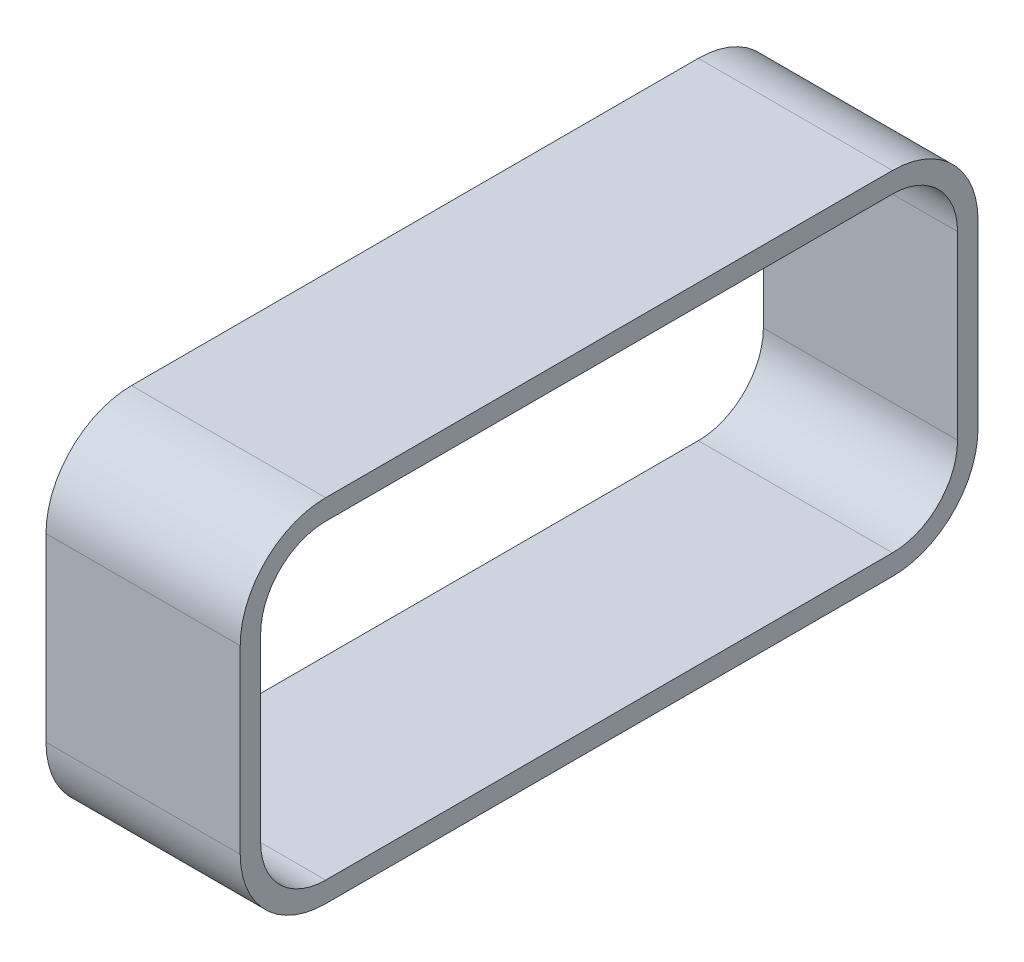
ISO-10303-21;
HEADER;
FILE_DESCRIPTION(('STEP AP214'),'2;1');
FILE_NAME('part.step','',(''),(''),'','','');
FILE_SCHEMA(('AUTOMOTIVE_DESIGN { 1 0 10303 214 1 1 1 1 }'));
ENDSEC;
DATA;
#1=APPLICATION_CONTEXT('core data for automotive mechanical design processes');
#2=APPLICATION_PROTOCOL_DEFINITION('international standard','automotive_design',2000,#1);
#3=PRODUCT_CONTEXT('',#1,'mechanical');
#4=PRODUCT('Part','Part','',(#3));
#5=PRODUCT_RELATED_PRODUCT_CATEGORY('part','',(#4));
#6=PRODUCT_DEFINITION_FORMATION('','',#4);
#7=PRODUCT_DEFINITION_CONTEXT('part definition',#1,'design');
#8=PRODUCT_DEFINITION('design','',#6,#7);
#9=PRODUCT_DEFINITION_SHAPE('','',#8);
#10=(LENGTH_UNIT() NAMED_UNIT(*) SI_UNIT(.MILLI.,.METRE.));
#11=(NAMED_UNIT(*) PLANE_ANGLE_UNIT() SI_UNIT($,.RADIAN.));
#12=(NAMED_UNIT(*) SI_UNIT($,.STERADIAN.) SOLID_ANGLE_UNIT());
#13=UNCERTAINTY_MEASURE_WITH_UNIT(LENGTH_MEASURE(1.E-05),#10,'distance_accuracy_value','');
#14=(GEOMETRIC_REPRESENTATION_CONTEXT(3) GLOBAL_UNCERTAINTY_ASSIGNED_CONTEXT((#13)) GLOBAL_UNIT_ASSIGNED_CONTEXT((#10,
#11,#12)) REPRESENTATION_CONTEXT('',''));
#15=CARTESIAN_POINT('',(0.,0.,0.));
#16=DIRECTION('',(0.,0.,1.));
#17=DIRECTION('',(1.,0.,0.));
#18=AXIS2_PLACEMENT_3D('',#15,#16,#17);
#19=CARTESIAN_POINT('',(1045.,1322.,-3050.));
#20=DIRECTION('',(-1.,0.,0.));
#21=DIRECTION('',(0.,0.,1.));
#22=AXIS2_PLACEMENT_3D('',#19,#20,#21);
#23=PLANE('',#22);
#24=CARTESIAN_POINT('',(1045.,1322.,-3050.));
#25=DIRECTION('',(1.,0.,0.));
#26=DIRECTION('',(0.,0.,1.));
#27=AXIS2_PLACEMENT_3D('',#24,#25,#26);
#28=CIRCLE('',#27,459.999999999999);
#29=CARTESIAN_POINT('',(1045.,1322.,-3510.));
#30=VERTEX_POINT('',#29);
#31=CARTESIAN_POINT('',(1045.,1782.,-3050.));
#32=VERTEX_POINT('',#31);
#33=EDGE_CURVE('E241',#30,#32,#28,.T.);
#34=ORIENTED_EDGE('',*,*,#33,.T.);
#35=DIRECTION('',(0.,0.,1.));
#36=VECTOR('',#35,1.);
#37=CARTESIAN_POINT('',(1045.,1782.,-4.44089209850063E-13));
#38=LINE('',#37,#36);
#39=CARTESIAN_POINT('',(1045.,1782.,-4.44089209850063E-13));
#40=VERTEX_POINT('',#39);
#41=EDGE_CURVE('E245',#32,#40,#38,.T.);
#42=ORIENTED_EDGE('',*,*,#41,.T.);
#43=CARTESIAN_POINT('',(1045.,1322.,-4.44089209850063E-13));
#44=DIRECTION('',(1.,0.,0.));
#45=DIRECTION('',(0.,0.,-1.));
#46=AXIS2_PLACEMENT_3D('',#43,#44,#45);
#47=CIRCLE('',#46,459.999999999999);
#48=CARTESIAN_POINT('',(1045.,1322.,459.999999999999));
#49=VERTEX_POINT('',#48);
#50=EDGE_CURVE('E249',#40,#49,#47,.T.);
#51=ORIENTED_EDGE('',*,*,#50,.T.);
#52=DIRECTION('',(0.,-1.,0.));
#53=VECTOR('',#52,1.);
#54=CARTESIAN_POINT('',(1045.,1322.,459.999999999998));
#55=LINE('',#54,#53);
#56=CARTESIAN_POINT('',(1045.,350.,459.999999999998));
#57=VERTEX_POINT('',#56);
#58=EDGE_CURVE('E252',#49,#57,#55,.T.);
#59=ORIENTED_EDGE('',*,*,#58,.T.);
#60=CARTESIAN_POINT('',(1045.,350.,3.60822483003176E-12));
#61=DIRECTION('',(1.,0.,0.));
#62=DIRECTION('',(0.,0.,-1.));
#63=AXIS2_PLACEMENT_3D('',#60,#61,#62);
#64=CIRCLE('',#63,459.999999999995);
#65=CARTESIAN_POINT('',(1045.,-109.999999999995,0.));
#66=VERTEX_POINT('',#65);
#67=EDGE_CURVE('E255',#57,#66,#64,.T.);
#68=ORIENTED_EDGE('',*,*,#67,.T.);
#69=DIRECTION('',(0.,0.,-1.));
#70=VECTOR('',#69,1.);
#71=CARTESIAN_POINT('',(1045.,-109.999999999995,-3050.));
#72=LINE('',#71,#70);
#73=CARTESIAN_POINT('',(1045.,-109.999999999995,-3050.));
#74=VERTEX_POINT('',#73);
#75=EDGE_CURVE('E258',#66,#74,#72,.T.);
#76=ORIENTED_EDGE('',*,*,#75,.T.);
#77=CARTESIAN_POINT('',(1045.,350.,-3050.));
#78=DIRECTION('',(1.,0.,0.));
#79=DIRECTION('',(0.,0.,1.));
#80=AXIS2_PLACEMENT_3D('',#77,#78,#79);
#81=CIRCLE('',#80,459.999999999995);
#82=CARTESIAN_POINT('',(1045.,350.,-3510.));
#83=VERTEX_POINT('',#82);
#84=EDGE_CURVE('E261',#74,#83,#81,.T.);
#85=ORIENTED_EDGE('',*,*,#84,.T.);
#86=DIRECTION('',(0.,1.,0.));
#87=VECTOR('',#86,1.);
#88=CARTESIAN_POINT('',(1045.,1322.,-3510.));
#89=LINE('',#88,#87);
#90=EDGE_CURVE('E264',#83,#30,#89,.T.);
#91=ORIENTED_EDGE('',*,*,#90,.T.);
#92=EDGE_LOOP('',(#34,#42,#51,#59,#68,#76,#85,#91));
#93=FACE_BOUND('',#92,.T.);
#94=CARTESIAN_POINT('',(1045.,350.,0.));
#95=DIRECTION('',(1.,0.,0.));
#96=DIRECTION('',(0.,0.,1.));
#97=AXIS2_PLACEMENT_3D('',#94,#95,#96);
#98=CIRCLE('',#97,350.);
#99=CARTESIAN_POINT('',(1045.,350.,350.));
#100=VERTEX_POINT('',#99);
#101=CARTESIAN_POINT('',(1045.,0.,0.));
#102=VERTEX_POINT('',#101);
#103=EDGE_CURVE('E152',#100,#102,#98,.T.);
#104=ORIENTED_EDGE('',*,*,#103,.F.);
#105=DIRECTION('',(0.,-1.,0.));
#106=VECTOR('',#105,1.);
#107=CARTESIAN_POINT('',(1045.,350.,350.));
#108=LINE('',#107,#106);
#109=CARTESIAN_POINT('',(1045.,1322.,350.));
#110=VERTEX_POINT('',#109);
#111=EDGE_CURVE('E193',#110,#100,#108,.T.);
#112=ORIENTED_EDGE('',*,*,#111,.F.);
#113=CARTESIAN_POINT('',(1045.,1322.,9.43689570931383E-13));
#114=DIRECTION('',(1.,0.,0.));
#115=DIRECTION('',(0.,0.,1.));
#116=AXIS2_PLACEMENT_3D('',#113,#114,#115);
#117=CIRCLE('',#116,349.999999999999);
#118=CARTESIAN_POINT('',(1045.,1672.,-4.44089209850063E-13));
#119=VERTEX_POINT('',#118);
#120=EDGE_CURVE('E190',#119,#110,#117,.T.);
#121=ORIENTED_EDGE('',*,*,#120,.F.);
#122=DIRECTION('',(0.,0.,1.));
#123=VECTOR('',#122,1.);
#124=CARTESIAN_POINT('',(1045.,1672.,-3050.));
#125=LINE('',#124,#123);
#126=CARTESIAN_POINT('',(1045.,1672.,-3050.));
#127=VERTEX_POINT('',#126);
#128=EDGE_CURVE('E187',#127,#119,#125,.T.);
#129=ORIENTED_EDGE('',*,*,#128,.F.);
#130=CARTESIAN_POINT('',(1045.,1322.,-3050.));
#131=DIRECTION('',(1.,0.,0.));
#132=DIRECTION('',(0.,0.,1.));
#133=AXIS2_PLACEMENT_3D('',#130,#131,#132);
#134=CIRCLE('',#133,350.);
#135=CARTESIAN_POINT('',(1045.,1322.,-3400.));
#136=VERTEX_POINT('',#135);
#137=EDGE_CURVE('E184',#136,#127,#134,.T.);
#138=ORIENTED_EDGE('',*,*,#137,.F.);
#139=DIRECTION('',(0.,1.,0.));
#140=VECTOR('',#139,1.);
#141=CARTESIAN_POINT('',(1045.,1322.,-3400.));
#142=LINE('',#141,#140);
#143=CARTESIAN_POINT('',(1045.,350.,-3400.));
#144=VERTEX_POINT('',#143);
#145=EDGE_CURVE('E179',#144,#136,#142,.T.);
#146=ORIENTED_EDGE('',*,*,#145,.F.);
#147=CARTESIAN_POINT('',(1045.,350.,-3050.));
#148=DIRECTION('',(1.,0.,0.));
#149=DIRECTION('',(0.,0.,-1.));
#150=AXIS2_PLACEMENT_3D('',#147,#148,#149);
#151=CIRCLE('',#150,350.);
#152=CARTESIAN_POINT('',(1045.,0.,-3050.));
#153=VERTEX_POINT('',#152);
#154=EDGE_CURVE('E175',#153,#144,#151,.T.);
#155=ORIENTED_EDGE('',*,*,#154,.F.);
#156=DIRECTION('',(0.,0.,-1.));
#157=VECTOR('',#156,1.);
#158=CARTESIAN_POINT('',(1045.,0.,0.));
#159=LINE('',#158,#157);
#160=EDGE_CURVE('E161',#102,#153,#159,.T.);
#161=ORIENTED_EDGE('',*,*,#160,.F.);
#162=EDGE_LOOP('',(#104,#112,#121,#129,#138,#146,#155,#161));
#163=FACE_BOUND('',#162,.T.);
#164=ADVANCED_FACE('F38',(#93,#163),#23,.F.);
#165=CARTESIAN_POINT('',(0.,1322.,-3050.));
#166=DIRECTION('',(-1.,0.,0.));
#167=DIRECTION('',(0.,0.,1.));
#168=AXIS2_PLACEMENT_3D('',#165,#166,#167);
#169=PLANE('',#168);
#170=CARTESIAN_POINT('',(0.,1322.,-3050.));
#171=DIRECTION('',(1.,0.,0.));
#172=DIRECTION('',(0.,0.,1.));
#173=AXIS2_PLACEMENT_3D('',#170,#171,#172);
#174=CIRCLE('',#173,459.999999999999);
#175=CARTESIAN_POINT('',(0.,1322.,-3510.));
#176=VERTEX_POINT('',#175);
#177=CARTESIAN_POINT('',(0.,1782.,-3050.));
#178=VERTEX_POINT('',#177);
#179=EDGE_CURVE('E170',#176,#178,#174,.T.);
#180=ORIENTED_EDGE('',*,*,#179,.F.);
#181=DIRECTION('',(0.,1.,0.));
#182=VECTOR('',#181,1.);
#183=CARTESIAN_POINT('',(0.,1322.,-3510.));
#184=LINE('',#183,#182);
#185=CARTESIAN_POINT('',(0.,350.,-3510.));
#186=VERTEX_POINT('',#185);
#187=EDGE_CURVE('E246',#186,#176,#184,.T.);
#188=ORIENTED_EDGE('',*,*,#187,.F.);
#189=CARTESIAN_POINT('',(0.,350.,-3050.));
#190=DIRECTION('',(1.,0.,0.));
#191=DIRECTION('',(0.,0.,1.));
#192=AXIS2_PLACEMENT_3D('',#189,#190,#191);
#193=CIRCLE('',#192,459.999999999995);
#194=CARTESIAN_POINT('',(0.,-109.999999999995,-3050.));
#195=VERTEX_POINT('',#194);
#196=EDGE_CURVE('E286',#195,#186,#193,.T.);
#197=ORIENTED_EDGE('',*,*,#196,.F.);
#198=DIRECTION('',(0.,0.,-1.));
#199=VECTOR('',#198,1.);
#200=CARTESIAN_POINT('',(0.,-109.999999999995,-3050.));
#201=LINE('',#200,#199);
#202=CARTESIAN_POINT('',(0.,-109.999999999995,0.));
#203=VERTEX_POINT('',#202);
#204=EDGE_CURVE('E283',#203,#195,#201,.T.);
#205=ORIENTED_EDGE('',*,*,#204,.F.);
#206=CARTESIAN_POINT('',(0.,350.,3.60822483003176E-12));
#207=DIRECTION('',(1.,0.,0.));
#208=DIRECTION('',(0.,0.,-1.));
#209=AXIS2_PLACEMENT_3D('',#206,#207,#208);
#210=CIRCLE('',#209,459.999999999995);
#211=CARTESIAN_POINT('',(0.,350.,459.999999999998));
#212=VERTEX_POINT('',#211);
#213=EDGE_CURVE('E280',#212,#203,#210,.T.);
#214=ORIENTED_EDGE('',*,*,#213,.F.);
#215=DIRECTION('',(0.,-1.,0.));
#216=VECTOR('',#215,1.);
#217=CARTESIAN_POINT('',(0.,1322.,459.999999999998));
#218=LINE('',#217,#216);
#219=CARTESIAN_POINT('',(0.,1322.,459.999999999999));
#220=VERTEX_POINT('',#219);
#221=EDGE_CURVE('E277',#220,#212,#218,.T.);
#222=ORIENTED_EDGE('',*,*,#221,.F.);
#223=CARTESIAN_POINT('',(0.,1322.,-4.44089209850063E-13));
#224=DIRECTION('',(1.,0.,0.));
#225=DIRECTION('',(0.,0.,-1.));
#226=AXIS2_PLACEMENT_3D('',#223,#224,#225);
#227=CIRCLE('',#226,459.999999999999);
#228=CARTESIAN_POINT('',(0.,1782.,-4.44089209850063E-13));
#229=VERTEX_POINT('',#228);
#230=EDGE_CURVE('E274',#229,#220,#227,.T.);
#231=ORIENTED_EDGE('',*,*,#230,.F.);
#232=DIRECTION('',(0.,0.,1.));
#233=VECTOR('',#232,1.);
#234=CARTESIAN_POINT('',(0.,1782.,-4.44089209850063E-13));
#235=LINE('',#234,#233);
#236=EDGE_CURVE('E271',#178,#229,#235,.T.);
#237=ORIENTED_EDGE('',*,*,#236,.F.);
#238=EDGE_LOOP('',(#180,#188,#197,#205,#214,#222,#231,#237));
#239=FACE_BOUND('',#238,.T.);
#240=DIRECTION('',(0.,-1.,0.));
#241=VECTOR('',#240,1.);
#242=CARTESIAN_POINT('',(0.,350.,350.));
#243=LINE('',#242,#241);
#244=CARTESIAN_POINT('',(0.,1322.,350.));
#245=VERTEX_POINT('',#244);
#246=CARTESIAN_POINT('',(0.,350.,350.));
#247=VERTEX_POINT('',#246);
#248=EDGE_CURVE('E162',#245,#247,#243,.T.);
#249=ORIENTED_EDGE('',*,*,#248,.T.);
#250=CARTESIAN_POINT('',(0.,350.,0.));
#251=DIRECTION('',(1.,0.,0.));
#252=DIRECTION('',(0.,0.,1.));
#253=AXIS2_PLACEMENT_3D('',#250,#251,#252);
#254=CIRCLE('',#253,350.);
#255=CARTESIAN_POINT('',(0.,0.,0.));
#256=VERTEX_POINT('',#255);
#257=EDGE_CURVE('E62',#247,#256,#254,.T.);
#258=ORIENTED_EDGE('',*,*,#257,.T.);
#259=DIRECTION('',(0.,0.,-1.));
#260=VECTOR('',#259,1.);
#261=CARTESIAN_POINT('',(0.,0.,0.));
#262=LINE('',#261,#260);
#263=CARTESIAN_POINT('',(0.,0.,-3050.));
#264=VERTEX_POINT('',#263);
#265=EDGE_CURVE('E168',#256,#264,#262,.T.);
#266=ORIENTED_EDGE('',*,*,#265,.T.);
#267=CARTESIAN_POINT('',(0.,350.,-3050.));
#268=DIRECTION('',(1.,0.,0.));
#269=DIRECTION('',(0.,0.,-1.));
#270=AXIS2_PLACEMENT_3D('',#267,#268,#269);
#271=CIRCLE('',#270,350.);
#272=CARTESIAN_POINT('',(0.,350.,-3400.));
#273=VERTEX_POINT('',#272);
#274=EDGE_CURVE('E200',#264,#273,#271,.T.);
#275=ORIENTED_EDGE('',*,*,#274,.T.);
#276=DIRECTION('',(0.,1.,0.));
#277=VECTOR('',#276,1.);
#278=CARTESIAN_POINT('',(0.,1322.,-3400.));
#279=LINE('',#278,#277);
#280=CARTESIAN_POINT('',(0.,1322.,-3400.));
#281=VERTEX_POINT('',#280);
#282=EDGE_CURVE('E204',#273,#281,#279,.T.);
#283=ORIENTED_EDGE('',*,*,#282,.T.);
#284=CARTESIAN_POINT('',(0.,1322.,-3050.));
#285=DIRECTION('',(1.,0.,0.));
#286=DIRECTION('',(0.,0.,1.));
#287=AXIS2_PLACEMENT_3D('',#284,#285,#286);
#288=CIRCLE('',#287,350.);
#289=CARTESIAN_POINT('',(0.,1672.,-3050.));
#290=VERTEX_POINT('',#289);
#291=EDGE_CURVE('E208',#281,#290,#288,.T.);
#292=ORIENTED_EDGE('',*,*,#291,.T.);
#293=DIRECTION('',(0.,0.,1.));
#294=VECTOR('',#293,1.);
#295=CARTESIAN_POINT('',(0.,1672.,-3050.));
#296=LINE('',#295,#294);
#297=CARTESIAN_POINT('',(0.,1672.,-4.44089209850063E-13));
#298=VERTEX_POINT('',#297);
#299=EDGE_CURVE('E212',#290,#298,#296,.T.);
#300=ORIENTED_EDGE('',*,*,#299,.T.);
#301=CARTESIAN_POINT('',(0.,1322.,9.43689570931383E-13));
#302=DIRECTION('',(1.,0.,0.));
#303=DIRECTION('',(0.,0.,1.));
#304=AXIS2_PLACEMENT_3D('',#301,#302,#303);
#305=CIRCLE('',#304,349.999999999999);
#306=EDGE_CURVE('E216',#298,#245,#305,.T.);
#307=ORIENTED_EDGE('',*,*,#306,.T.);
#308=EDGE_LOOP('',(#249,#258,#266,#275,#283,#292,#300,#307));
#309=FACE_BOUND('',#308,.T.);
#310=ADVANCED_FACE('F325',(#239,#309),#169,.T.);
#311=CARTESIAN_POINT('',(1045.,1322.,-3050.));
#312=DIRECTION('',(-1.,0.,0.));
#313=DIRECTION('',(0.,0.,1.));
#314=AXIS2_PLACEMENT_3D('',#311,#312,#313);
#315=CYLINDRICAL_SURFACE('',#314,459.999999999999);
#316=ORIENTED_EDGE('',*,*,#179,.T.);
#317=DIRECTION('',(-1.,0.,0.));
#318=VECTOR('',#317,1.);
#319=CARTESIAN_POINT('',(1045.,1782.,-3050.));
#320=LINE('',#319,#318);
#321=EDGE_CURVE('E11',#32,#178,#320,.T.);
#322=ORIENTED_EDGE('',*,*,#321,.F.);
#323=ORIENTED_EDGE('',*,*,#33,.F.);
#324=DIRECTION('',(-1.,0.,0.));
#325=VECTOR('',#324,1.);
#326=CARTESIAN_POINT('',(1045.,1322.,-3510.));
#327=LINE('',#326,#325);
#328=EDGE_CURVE('E267',#30,#176,#327,.T.);
#329=ORIENTED_EDGE('',*,*,#328,.T.);
#330=EDGE_LOOP('',(#316,#322,#323,#329));
#331=FACE_BOUND('',#330,.T.);
#332=ADVANCED_FACE('F40',(#331),#315,.T.);
#333=CARTESIAN_POINT('',(1045.,1782.,-4.44089209850063E-13));
#334=DIRECTION('',(0.,-1.,0.));
#335=DIRECTION('',(0.,0.,-1.));
#336=AXIS2_PLACEMENT_3D('',#333,#334,#335);
#337=PLANE('',#336);
#338=ORIENTED_EDGE('',*,*,#236,.T.);
#339=DIRECTION('',(-1.,0.,0.));
#340=VECTOR('',#339,1.);
#341=CARTESIAN_POINT('',(1045.,1782.,-4.44089209850063E-13));
#342=LINE('',#341,#340);
#343=EDGE_CURVE('E47',#40,#229,#342,.T.);
#344=ORIENTED_EDGE('',*,*,#343,.F.);
#345=ORIENTED_EDGE('',*,*,#41,.F.);
#346=ORIENTED_EDGE('',*,*,#321,.T.);
#347=EDGE_LOOP('',(#338,#344,#345,#346));
#348=FACE_BOUND('',#347,.T.);
#349=ADVANCED_FACE('F342',(#348),#337,.F.);
#350=CARTESIAN_POINT('',(1045.,1322.,-4.44089209850063E-13));
#351=DIRECTION('',(-1.,0.,0.));
#352=DIRECTION('',(0.,0.,1.));
#353=AXIS2_PLACEMENT_3D('',#350,#351,#352);
#354=CYLINDRICAL_SURFACE('',#353,459.999999999999);
#355=ORIENTED_EDGE('',*,*,#230,.T.);
#356=DIRECTION('',(-1.,0.,0.));
#357=VECTOR('',#356,1.);
#358=CARTESIAN_POINT('',(1045.,1322.,459.999999999999));
#359=LINE('',#358,#357);
#360=EDGE_CURVE('E310',#49,#220,#359,.T.);
#361=ORIENTED_EDGE('',*,*,#360,.F.);
#362=ORIENTED_EDGE('',*,*,#50,.F.);
#363=ORIENTED_EDGE('',*,*,#343,.T.);
#364=EDGE_LOOP('',(#355,#361,#362,#363));
#365=FACE_BOUND('',#364,.T.);
#366=ADVANCED_FACE('F319',(#365),#354,.T.);
#367=CARTESIAN_POINT('',(1045.,1322.,459.999999999998));
#368=DIRECTION('',(0.,0.,-1.));
#369=DIRECTION('',(-1.,0.,0.));
#370=AXIS2_PLACEMENT_3D('',#367,#368,#369);
#371=PLANE('',#370);
#372=ORIENTED_EDGE('',*,*,#221,.T.);
#373=DIRECTION('',(-1.,0.,0.));
#374=VECTOR('',#373,1.);
#375=CARTESIAN_POINT('',(1045.,350.,459.999999999998));
#376=LINE('',#375,#374);
#377=EDGE_CURVE('E306',#57,#212,#376,.T.);
#378=ORIENTED_EDGE('',*,*,#377,.F.);
#379=ORIENTED_EDGE('',*,*,#58,.F.);
#380=ORIENTED_EDGE('',*,*,#360,.T.);
#381=EDGE_LOOP('',(#372,#378,#379,#380));
#382=FACE_BOUND('',#381,.T.);
#383=ADVANCED_FACE('F331',(#382),#371,.F.);
#384=CARTESIAN_POINT('',(1045.,350.,3.60822483003176E-12));
#385=DIRECTION('',(-1.,0.,0.));
#386=DIRECTION('',(0.,0.,1.));
#387=AXIS2_PLACEMENT_3D('',#384,#385,#386);
#388=CYLINDRICAL_SURFACE('',#387,459.999999999995);
#389=ORIENTED_EDGE('',*,*,#213,.T.);
#390=DIRECTION('',(-1.,0.,0.));
#391=VECTOR('',#390,1.);
#392=CARTESIAN_POINT('',(1045.,-109.999999999995,0.));
#393=LINE('',#392,#391);
#394=EDGE_CURVE('E302',#66,#203,#393,.T.);
#395=ORIENTED_EDGE('',*,*,#394,.F.);
#396=ORIENTED_EDGE('',*,*,#67,.F.);
#397=ORIENTED_EDGE('',*,*,#377,.T.);
#398=EDGE_LOOP('',(#389,#395,#396,#397));
#399=FACE_BOUND('',#398,.T.);
#400=ADVANCED_FACE('F335',(#399),#388,.T.);
#401=CARTESIAN_POINT('',(1045.,-109.999999999995,-3050.));
#402=DIRECTION('',(0.,1.,0.));
#403=DIRECTION('',(0.,0.,1.));
#404=AXIS2_PLACEMENT_3D('',#401,#402,#403);
#405=PLANE('',#404);
#406=ORIENTED_EDGE('',*,*,#204,.T.);
#407=DIRECTION('',(-1.,0.,0.));
#408=VECTOR('',#407,1.);
#409=CARTESIAN_POINT('',(1045.,-109.999999999995,-3050.));
#410=LINE('',#409,#408);
#411=EDGE_CURVE('E298',#74,#195,#410,.T.);
#412=ORIENTED_EDGE('',*,*,#411,.F.);
#413=ORIENTED_EDGE('',*,*,#75,.F.);
#414=ORIENTED_EDGE('',*,*,#394,.T.);
#415=EDGE_LOOP('',(#406,#412,#413,#414));
#416=FACE_BOUND('',#415,.T.);
#417=ADVANCED_FACE('F355',(#416),#405,.F.);
#418=CARTESIAN_POINT('',(1045.,350.,-3050.));
#419=DIRECTION('',(-1.,0.,0.));
#420=DIRECTION('',(0.,0.,1.));
#421=AXIS2_PLACEMENT_3D('',#418,#419,#420);
#422=CYLINDRICAL_SURFACE('',#421,459.999999999995);
#423=ORIENTED_EDGE('',*,*,#196,.T.);
#424=DIRECTION('',(-1.,0.,0.));
#425=VECTOR('',#424,1.);
#426=CARTESIAN_POINT('',(1045.,350.,-3510.));
#427=LINE('',#426,#425);
#428=EDGE_CURVE('E294',#83,#186,#427,.T.);
#429=ORIENTED_EDGE('',*,*,#428,.F.);
#430=ORIENTED_EDGE('',*,*,#84,.F.);
#431=ORIENTED_EDGE('',*,*,#411,.T.);
#432=EDGE_LOOP('',(#423,#429,#430,#431));
#433=FACE_BOUND('',#432,.T.);
#434=ADVANCED_FACE('F353',(#433),#422,.T.);
#435=CARTESIAN_POINT('',(1045.,1322.,-3510.));
#436=DIRECTION('',(0.,0.,1.));
#437=DIRECTION('',(1.,0.,0.));
#438=AXIS2_PLACEMENT_3D('',#435,#436,#437);
#439=PLANE('',#438);
#440=ORIENTED_EDGE('',*,*,#187,.T.);
#441=ORIENTED_EDGE('',*,*,#328,.F.);
#442=ORIENTED_EDGE('',*,*,#90,.F.);
#443=ORIENTED_EDGE('',*,*,#428,.T.);
#444=EDGE_LOOP('',(#440,#441,#442,#443));
#445=FACE_BOUND('',#444,.T.);
#446=ADVANCED_FACE('F348',(#445),#439,.F.);
#447=CARTESIAN_POINT('',(1045.,350.,0.));
#448=DIRECTION('',(-1.,0.,0.));
#449=DIRECTION('',(0.,0.,1.));
#450=AXIS2_PLACEMENT_3D('',#447,#448,#449);
#451=CYLINDRICAL_SURFACE('',#450,350.);
#452=ORIENTED_EDGE('',*,*,#257,.F.);
#453=DIRECTION('',(-1.,0.,0.));
#454=VECTOR('',#453,1.);
#455=CARTESIAN_POINT('',(1045.,350.,350.));
#456=LINE('',#455,#454);
#457=EDGE_CURVE('E156',#100,#247,#456,.T.);
#458=ORIENTED_EDGE('',*,*,#457,.F.);
#459=ORIENTED_EDGE('',*,*,#103,.T.);
#460=DIRECTION('',(-1.,0.,0.));
#461=VECTOR('',#460,1.);
#462=CARTESIAN_POINT('',(1045.,0.,0.));
#463=LINE('',#462,#461);
#464=EDGE_CURVE('E155',#102,#256,#463,.T.);
#465=ORIENTED_EDGE('',*,*,#464,.T.);
#466=EDGE_LOOP('',(#452,#458,#459,#465));
#467=FACE_BOUND('',#466,.T.);
#468=ADVANCED_FACE('F154',(#467),#451,.F.);
#469=CARTESIAN_POINT('',(1045.,0.,0.));
#470=DIRECTION('',(0.,1.,0.));
#471=DIRECTION('',(0.,0.,1.));
#472=AXIS2_PLACEMENT_3D('',#469,#470,#471);
#473=PLANE('',#472);
#474=ORIENTED_EDGE('',*,*,#265,.F.);
#475=ORIENTED_EDGE('',*,*,#464,.F.);
#476=ORIENTED_EDGE('',*,*,#160,.T.);
#477=DIRECTION('',(-1.,0.,0.));
#478=VECTOR('',#477,1.);
#479=CARTESIAN_POINT('',(1045.,0.,-3050.));
#480=LINE('',#479,#478);
#481=EDGE_CURVE('E171',#153,#264,#480,.T.);
#482=ORIENTED_EDGE('',*,*,#481,.T.);
#483=EDGE_LOOP('',(#474,#475,#476,#482));
#484=FACE_BOUND('',#483,.T.);
#485=ADVANCED_FACE('F165',(#484),#473,.T.);
#486=CARTESIAN_POINT('',(1045.,350.,-3050.));
#487=DIRECTION('',(-1.,0.,0.));
#488=DIRECTION('',(0.,0.,1.));
#489=AXIS2_PLACEMENT_3D('',#486,#487,#488);
#490=CYLINDRICAL_SURFACE('',#489,350.);
#491=ORIENTED_EDGE('',*,*,#274,.F.);
#492=ORIENTED_EDGE('',*,*,#481,.F.);
#493=ORIENTED_EDGE('',*,*,#154,.T.);
#494=DIRECTION('',(-1.,0.,0.));
#495=VECTOR('',#494,1.);
#496=CARTESIAN_POINT('',(1045.,350.,-3400.));
#497=LINE('',#496,#495);
#498=EDGE_CURVE('E236',#144,#273,#497,.T.);
#499=ORIENTED_EDGE('',*,*,#498,.T.);
#500=EDGE_LOOP('',(#491,#492,#493,#499));
#501=FACE_BOUND('',#500,.T.);
#502=ADVANCED_FACE('F380',(#501),#490,.F.);
#503=CARTESIAN_POINT('',(1045.,1322.,-3400.));
#504=DIRECTION('',(0.,0.,1.));
#505=DIRECTION('',(0.,-1.,0.));
#506=AXIS2_PLACEMENT_3D('',#503,#504,#505);
#507=PLANE('',#506);
#508=ORIENTED_EDGE('',*,*,#282,.F.);
#509=ORIENTED_EDGE('',*,*,#498,.F.);
#510=ORIENTED_EDGE('',*,*,#145,.T.);
#511=DIRECTION('',(-1.,0.,0.));
#512=VECTOR('',#511,1.);
#513=CARTESIAN_POINT('',(1045.,1322.,-3400.));
#514=LINE('',#513,#512);
#515=EDGE_CURVE('E233',#136,#281,#514,.T.);
#516=ORIENTED_EDGE('',*,*,#515,.T.);
#517=EDGE_LOOP('',(#508,#509,#510,#516));
#518=FACE_BOUND('',#517,.T.);
#519=ADVANCED_FACE('F384',(#518),#507,.T.);
#520=CARTESIAN_POINT('',(1045.,1322.,-3050.));
#521=DIRECTION('',(-1.,0.,0.));
#522=DIRECTION('',(0.,0.,1.));
#523=AXIS2_PLACEMENT_3D('',#520,#521,#522);
#524=CYLINDRICAL_SURFACE('',#523,350.);
#525=ORIENTED_EDGE('',*,*,#291,.F.);
#526=ORIENTED_EDGE('',*,*,#515,.F.);
#527=ORIENTED_EDGE('',*,*,#137,.T.);
#528=DIRECTION('',(-1.,0.,0.));
#529=VECTOR('',#528,1.);
#530=CARTESIAN_POINT('',(1045.,1672.,-3050.));
#531=LINE('',#530,#529);
#532=EDGE_CURVE('E230',#127,#290,#531,.T.);
#533=ORIENTED_EDGE('',*,*,#532,.T.);
#534=EDGE_LOOP('',(#525,#526,#527,#533));
#535=FACE_BOUND('',#534,.T.);
#536=ADVANCED_FACE('F390',(#535),#524,.F.);
#537=CARTESIAN_POINT('',(1045.,1672.,-3050.));
#538=DIRECTION('',(0.,-1.,0.));
#539=DIRECTION('',(0.,0.,-1.));
#540=AXIS2_PLACEMENT_3D('',#537,#538,#539);
#541=PLANE('',#540);
#542=ORIENTED_EDGE('',*,*,#299,.F.);
#543=ORIENTED_EDGE('',*,*,#532,.F.);
#544=ORIENTED_EDGE('',*,*,#128,.T.);
#545=DIRECTION('',(-1.,0.,0.));
#546=VECTOR('',#545,1.);
#547=CARTESIAN_POINT('',(1045.,1672.,-4.44089209850063E-13));
#548=LINE('',#547,#546);
#549=EDGE_CURVE('E227',#119,#298,#548,.T.);
#550=ORIENTED_EDGE('',*,*,#549,.T.);
#551=EDGE_LOOP('',(#542,#543,#544,#550));
#552=FACE_BOUND('',#551,.T.);
#553=ADVANCED_FACE('F394',(#552),#541,.T.);
#554=CARTESIAN_POINT('',(1045.,1322.,9.43689570931383E-13));
#555=DIRECTION('',(-1.,0.,0.));
#556=DIRECTION('',(0.,0.,1.));
#557=AXIS2_PLACEMENT_3D('',#554,#555,#556);
#558=CYLINDRICAL_SURFACE('',#557,349.999999999999);
#559=ORIENTED_EDGE('',*,*,#306,.F.);
#560=ORIENTED_EDGE('',*,*,#549,.F.);
#561=ORIENTED_EDGE('',*,*,#120,.T.);
#562=DIRECTION('',(-1.,0.,0.));
#563=VECTOR('',#562,1.);
#564=CARTESIAN_POINT('',(1045.,1322.,350.));
#565=LINE('',#564,#563);
#566=EDGE_CURVE('E54',#110,#245,#565,.T.);
#567=ORIENTED_EDGE('',*,*,#566,.T.);
#568=EDGE_LOOP('',(#559,#560,#561,#567));
#569=FACE_BOUND('',#568,.T.);
#570=ADVANCED_FACE('F398',(#569),#558,.F.);
#571=CARTESIAN_POINT('',(1045.,350.,350.));
#572=DIRECTION('',(0.,0.,-1.));
#573=DIRECTION('',(-1.,0.,0.));
#574=AXIS2_PLACEMENT_3D('',#571,#572,#573);
#575=PLANE('',#574);
#576=ORIENTED_EDGE('',*,*,#248,.F.);
#577=ORIENTED_EDGE('',*,*,#566,.F.);
#578=ORIENTED_EDGE('',*,*,#111,.T.);
#579=ORIENTED_EDGE('',*,*,#457,.T.);
#580=EDGE_LOOP('',(#576,#577,#578,#579));
#581=FACE_BOUND('',#580,.T.);
#582=ADVANCED_FACE('F402',(#581),#575,.T.);
#583=CLOSED_SHELL('',(#164,#310,#332,#349,#366,#383,#400,#417,#434,#446,#468,#485,#502,#519,
#536,#553,#570,#582));
#584=MANIFOLD_SOLID_BREP('B2',#583);
#585=ADVANCED_BREP_SHAPE_REPRESENTATION('',(#18,#584),#14);
#586=SHAPE_DEFINITION_REPRESENTATION(#9,#585);
ENDSEC;
END-ISO-10303-21;
